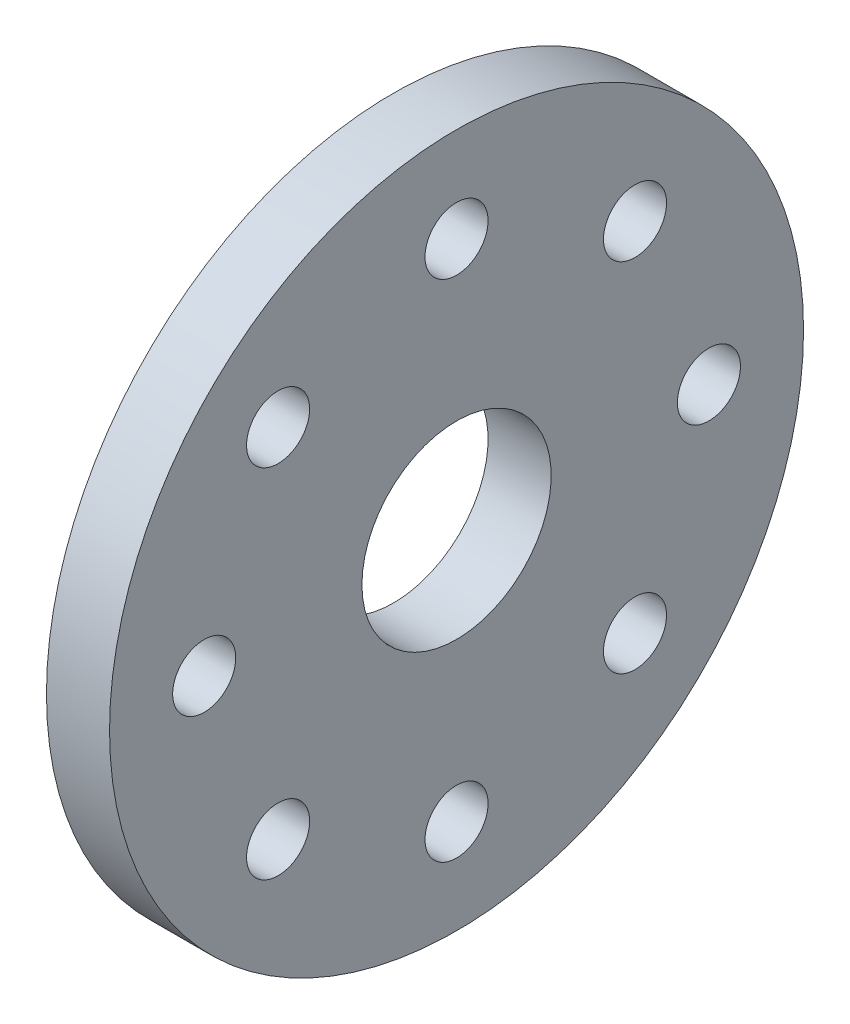
ISO-10303-21;
HEADER;
FILE_DESCRIPTION(('STEP AP214'),'2;1');
FILE_NAME('part.step','',(''),(''),'','','');
FILE_SCHEMA(('AUTOMOTIVE_DESIGN { 1 0 10303 214 1 1 1 1 }'));
ENDSEC;
DATA;
#1=APPLICATION_CONTEXT('core data for automotive mechanical design processes');
#2=APPLICATION_PROTOCOL_DEFINITION('international standard','automotive_design',2000,#1);
#3=PRODUCT_CONTEXT('',#1,'mechanical');
#4=PRODUCT('Part','Part','',(#3));
#5=PRODUCT_RELATED_PRODUCT_CATEGORY('part','',(#4));
#6=PRODUCT_DEFINITION_FORMATION('','',#4);
#7=PRODUCT_DEFINITION_CONTEXT('part definition',#1,'design');
#8=PRODUCT_DEFINITION('design','',#6,#7);
#9=PRODUCT_DEFINITION_SHAPE('','',#8);
#10=(LENGTH_UNIT() NAMED_UNIT(*) SI_UNIT(.MILLI.,.METRE.));
#11=(NAMED_UNIT(*) PLANE_ANGLE_UNIT() SI_UNIT($,.RADIAN.));
#12=(NAMED_UNIT(*) SI_UNIT($,.STERADIAN.) SOLID_ANGLE_UNIT());
#13=UNCERTAINTY_MEASURE_WITH_UNIT(LENGTH_MEASURE(1.E-05),#10,'distance_accuracy_value','');
#14=(GEOMETRIC_REPRESENTATION_CONTEXT(3) GLOBAL_UNCERTAINTY_ASSIGNED_CONTEXT((#13)) GLOBAL_UNIT_ASSIGNED_CONTEXT((#10,
#11,#12)) REPRESENTATION_CONTEXT('',''));
#15=CARTESIAN_POINT('',(0.,0.,0.));
#16=DIRECTION('',(0.,0.,1.));
#17=DIRECTION('',(1.,0.,0.));
#18=AXIS2_PLACEMENT_3D('',#15,#16,#17);
#19=CARTESIAN_POINT('',(0.,0.,0.));
#20=DIRECTION('',(-1.,0.,0.));
#21=DIRECTION('',(0.,0.,1.));
#22=AXIS2_PLACEMENT_3D('',#19,#20,#21);
#23=CYLINDRICAL_SURFACE('',#22,3.);
#24=CARTESIAN_POINT('',(1.,0.,0.));
#25=DIRECTION('',(-1.,0.,0.));
#26=DIRECTION('',(0.,0.,1.));
#27=AXIS2_PLACEMENT_3D('',#24,#25,#26);
#28=CIRCLE('',#27,3.);
#29=CARTESIAN_POINT('',(1.,0.,3.));
#30=VERTEX_POINT('',#29);
#31=EDGE_CURVE('E28',#30,#30,#28,.T.);
#32=ORIENTED_EDGE('',*,*,#31,.F.);
#33=EDGE_LOOP('',(#32));
#34=FACE_BOUND('',#33,.T.);
#35=CARTESIAN_POINT('',(-1.,0.,0.));
#36=DIRECTION('',(-1.,0.,0.));
#37=DIRECTION('',(0.,0.,1.));
#38=AXIS2_PLACEMENT_3D('',#35,#36,#37);
#39=CIRCLE('',#38,3.);
#40=CARTESIAN_POINT('',(-1.,0.,3.));
#41=VERTEX_POINT('',#40);
#42=EDGE_CURVE('E9',#41,#41,#39,.T.);
#43=ORIENTED_EDGE('',*,*,#42,.T.);
#44=EDGE_LOOP('',(#43));
#45=FACE_BOUND('',#44,.T.);
#46=ADVANCED_FACE('F14',(#34,#45),#23,.F.);
#47=CARTESIAN_POINT('',(-1.,3.,0.));
#48=DIRECTION('',(1.,0.,0.));
#49=DIRECTION('',(0.,0.,-1.));
#50=AXIS2_PLACEMENT_3D('',#47,#48,#49);
#51=PLANE('',#50);
#52=CARTESIAN_POINT('',(-1.,5.65685424949245,5.65685424949231));
#53=DIRECTION('',(-1.,0.,0.));
#54=DIRECTION('',(0.,-0.707106781186539,0.707106781186556));
#55=AXIS2_PLACEMENT_3D('',#52,#53,#54);
#56=CIRCLE('',#55,1.);
#57=CARTESIAN_POINT('',(-1.,4.94974746830591,6.36396103067887));
#58=VERTEX_POINT('',#57);
#59=EDGE_CURVE('E76',#58,#58,#56,.T.);
#60=ORIENTED_EDGE('',*,*,#59,.F.);
#61=EDGE_LOOP('',(#60));
#62=FACE_BOUND('',#61,.T.);
#63=CARTESIAN_POINT('',(-1.,0.,8.));
#64=DIRECTION('',(-1.,0.,0.));
#65=DIRECTION('',(0.,-1.,0.));
#66=AXIS2_PLACEMENT_3D('',#63,#64,#65);
#67=CIRCLE('',#66,1.);
#68=CARTESIAN_POINT('',(-1.,-0.999999999999916,8.00000000000001));
#69=VERTEX_POINT('',#68);
#70=EDGE_CURVE('E70',#69,#69,#67,.T.);
#71=ORIENTED_EDGE('',*,*,#70,.F.);
#72=EDGE_LOOP('',(#71));
#73=FACE_BOUND('',#72,.T.);
#74=CARTESIAN_POINT('',(-1.,-5.65685424949233,5.65685424949243));
#75=DIRECTION('',(-1.,0.,0.));
#76=DIRECTION('',(0.,-0.707106781186554,-0.707106781186541));
#77=AXIS2_PLACEMENT_3D('',#74,#75,#76);
#78=CIRCLE('',#77,1.);
#79=CARTESIAN_POINT('',(-1.,-6.36396103067888,4.94974746830589));
#80=VERTEX_POINT('',#79);
#81=EDGE_CURVE('E64',#80,#80,#78,.T.);
#82=ORIENTED_EDGE('',*,*,#81,.F.);
#83=EDGE_LOOP('',(#82));
#84=FACE_BOUND('',#83,.T.);
#85=CARTESIAN_POINT('',(-1.,-8.,0.));
#86=DIRECTION('',(-1.,0.,0.));
#87=DIRECTION('',(0.,0.,-1.));
#88=AXIS2_PLACEMENT_3D('',#85,#86,#87);
#89=CIRCLE('',#88,1.);
#90=CARTESIAN_POINT('',(-1.,-8.,-1.));
#91=VERTEX_POINT('',#90);
#92=EDGE_CURVE('E58',#91,#91,#89,.T.);
#93=ORIENTED_EDGE('',*,*,#92,.F.);
#94=EDGE_LOOP('',(#93));
#95=FACE_BOUND('',#94,.T.);
#96=CARTESIAN_POINT('',(-1.,-5.65685424949241,-5.65685424949235));
#97=DIRECTION('',(-1.,0.,0.));
#98=DIRECTION('',(0.,0.707106781186544,-0.707106781186551));
#99=AXIS2_PLACEMENT_3D('',#96,#97,#98);
#100=CIRCLE('',#99,1.);
#101=CARTESIAN_POINT('',(-1.,-4.94974746830587,-6.3639610306789));
#102=VERTEX_POINT('',#101);
#103=EDGE_CURVE('E52',#102,#102,#100,.T.);
#104=ORIENTED_EDGE('',*,*,#103,.F.);
#105=EDGE_LOOP('',(#104));
#106=FACE_BOUND('',#105,.T.);
#107=CARTESIAN_POINT('',(-1.,0.,-8.));
#108=DIRECTION('',(-1.,0.,0.));
#109=DIRECTION('',(0.,1.,0.));
#110=AXIS2_PLACEMENT_3D('',#107,#108,#109);
#111=CIRCLE('',#110,1.);
#112=CARTESIAN_POINT('',(-1.,0.999999999999972,-8.));
#113=VERTEX_POINT('',#112);
#114=EDGE_CURVE('E46',#113,#113,#111,.T.);
#115=ORIENTED_EDGE('',*,*,#114,.F.);
#116=EDGE_LOOP('',(#115));
#117=FACE_BOUND('',#116,.T.);
#118=CARTESIAN_POINT('',(-1.,5.65685424949237,-5.65685424949239));
#119=DIRECTION('',(-1.,0.,0.));
#120=DIRECTION('',(0.,0.707106781186549,0.707106781186546));
#121=AXIS2_PLACEMENT_3D('',#118,#119,#120);
#122=CIRCLE('',#121,1.);
#123=CARTESIAN_POINT('',(-1.,6.36396103067892,-4.94974746830584));
#124=VERTEX_POINT('',#123);
#125=EDGE_CURVE('E40',#124,#124,#122,.T.);
#126=ORIENTED_EDGE('',*,*,#125,.F.);
#127=EDGE_LOOP('',(#126));
#128=FACE_BOUND('',#127,.T.);
#129=CARTESIAN_POINT('',(-1.,8.,0.));
#130=DIRECTION('',(-1.,0.,0.));
#131=DIRECTION('',(0.,0.,1.));
#132=AXIS2_PLACEMENT_3D('',#129,#130,#131);
#133=CIRCLE('',#132,1.);
#134=CARTESIAN_POINT('',(-1.,8.,1.));
#135=VERTEX_POINT('',#134);
#136=EDGE_CURVE('E34',#135,#135,#133,.T.);
#137=ORIENTED_EDGE('',*,*,#136,.F.);
#138=EDGE_LOOP('',(#137));
#139=FACE_BOUND('',#138,.T.);
#140=ORIENTED_EDGE('',*,*,#42,.F.);
#141=EDGE_LOOP('',(#140));
#142=FACE_BOUND('',#141,.T.);
#143=CARTESIAN_POINT('',(-1.,0.,0.));
#144=DIRECTION('',(-1.,0.,0.));
#145=DIRECTION('',(0.,0.,1.));
#146=AXIS2_PLACEMENT_3D('',#143,#144,#145);
#147=CIRCLE('',#146,11.);
#148=CARTESIAN_POINT('',(-1.,0.,11.));
#149=VERTEX_POINT('',#148);
#150=EDGE_CURVE('E20',#149,#149,#147,.T.);
#151=ORIENTED_EDGE('',*,*,#150,.T.);
#152=EDGE_LOOP('',(#151));
#153=FACE_BOUND('',#152,.T.);
#154=ADVANCED_FACE('F92',(#62,#73,#84,#95,#106,#117,#128,#139,#142,#153),#51,.F.);
#155=CARTESIAN_POINT('',(0.,0.,0.));
#156=DIRECTION('',(-1.,0.,0.));
#157=DIRECTION('',(0.,0.,1.));
#158=AXIS2_PLACEMENT_3D('',#155,#156,#157);
#159=CYLINDRICAL_SURFACE('',#158,11.);
#160=ORIENTED_EDGE('',*,*,#150,.F.);
#161=EDGE_LOOP('',(#160));
#162=FACE_BOUND('',#161,.T.);
#163=CARTESIAN_POINT('',(1.,0.,0.));
#164=DIRECTION('',(-1.,0.,0.));
#165=DIRECTION('',(0.,0.,1.));
#166=AXIS2_PLACEMENT_3D('',#163,#164,#165);
#167=CIRCLE('',#166,11.);
#168=CARTESIAN_POINT('',(1.,0.,11.));
#169=VERTEX_POINT('',#168);
#170=EDGE_CURVE('E24',#169,#169,#167,.T.);
#171=ORIENTED_EDGE('',*,*,#170,.T.);
#172=EDGE_LOOP('',(#171));
#173=FACE_BOUND('',#172,.T.);
#174=ADVANCED_FACE('F95',(#162,#173),#159,.T.);
#175=CARTESIAN_POINT('',(1.,11.,0.));
#176=DIRECTION('',(-1.,0.,0.));
#177=DIRECTION('',(0.,0.,1.));
#178=AXIS2_PLACEMENT_3D('',#175,#176,#177);
#179=PLANE('',#178);
#180=CARTESIAN_POINT('',(1.,5.65685424949245,5.65685424949231));
#181=DIRECTION('',(-1.,0.,0.));
#182=DIRECTION('',(0.,-0.707106781186539,0.707106781186556));
#183=AXIS2_PLACEMENT_3D('',#180,#181,#182);
#184=CIRCLE('',#183,1.);
#185=CARTESIAN_POINT('',(1.,4.94974746830591,6.36396103067887));
#186=VERTEX_POINT('',#185);
#187=EDGE_CURVE('E73',#186,#186,#184,.T.);
#188=ORIENTED_EDGE('',*,*,#187,.T.);
#189=EDGE_LOOP('',(#188));
#190=FACE_BOUND('',#189,.T.);
#191=CARTESIAN_POINT('',(1.,0.,8.));
#192=DIRECTION('',(-1.,0.,0.));
#193=DIRECTION('',(0.,-1.,0.));
#194=AXIS2_PLACEMENT_3D('',#191,#192,#193);
#195=CIRCLE('',#194,1.);
#196=CARTESIAN_POINT('',(1.,-0.999999999999916,8.00000000000001));
#197=VERTEX_POINT('',#196);
#198=EDGE_CURVE('E67',#197,#197,#195,.T.);
#199=ORIENTED_EDGE('',*,*,#198,.T.);
#200=EDGE_LOOP('',(#199));
#201=FACE_BOUND('',#200,.T.);
#202=CARTESIAN_POINT('',(1.,-5.65685424949233,5.65685424949243));
#203=DIRECTION('',(-1.,0.,0.));
#204=DIRECTION('',(0.,-0.707106781186554,-0.707106781186541));
#205=AXIS2_PLACEMENT_3D('',#202,#203,#204);
#206=CIRCLE('',#205,1.);
#207=CARTESIAN_POINT('',(1.,-6.36396103067888,4.94974746830589));
#208=VERTEX_POINT('',#207);
#209=EDGE_CURVE('E61',#208,#208,#206,.T.);
#210=ORIENTED_EDGE('',*,*,#209,.T.);
#211=EDGE_LOOP('',(#210));
#212=FACE_BOUND('',#211,.T.);
#213=CARTESIAN_POINT('',(1.,-8.,0.));
#214=DIRECTION('',(-1.,0.,0.));
#215=DIRECTION('',(0.,0.,-1.));
#216=AXIS2_PLACEMENT_3D('',#213,#214,#215);
#217=CIRCLE('',#216,1.);
#218=CARTESIAN_POINT('',(1.,-8.,-1.));
#219=VERTEX_POINT('',#218);
#220=EDGE_CURVE('E55',#219,#219,#217,.T.);
#221=ORIENTED_EDGE('',*,*,#220,.T.);
#222=EDGE_LOOP('',(#221));
#223=FACE_BOUND('',#222,.T.);
#224=CARTESIAN_POINT('',(1.,-5.65685424949241,-5.65685424949235));
#225=DIRECTION('',(-1.,0.,0.));
#226=DIRECTION('',(0.,0.707106781186544,-0.707106781186551));
#227=AXIS2_PLACEMENT_3D('',#224,#225,#226);
#228=CIRCLE('',#227,1.);
#229=CARTESIAN_POINT('',(1.,-4.94974746830587,-6.3639610306789));
#230=VERTEX_POINT('',#229);
#231=EDGE_CURVE('E49',#230,#230,#228,.T.);
#232=ORIENTED_EDGE('',*,*,#231,.T.);
#233=EDGE_LOOP('',(#232));
#234=FACE_BOUND('',#233,.T.);
#235=CARTESIAN_POINT('',(1.,0.,-8.));
#236=DIRECTION('',(-1.,0.,0.));
#237=DIRECTION('',(0.,1.,0.));
#238=AXIS2_PLACEMENT_3D('',#235,#236,#237);
#239=CIRCLE('',#238,1.);
#240=CARTESIAN_POINT('',(1.,0.999999999999972,-8.));
#241=VERTEX_POINT('',#240);
#242=EDGE_CURVE('E43',#241,#241,#239,.T.);
#243=ORIENTED_EDGE('',*,*,#242,.T.);
#244=EDGE_LOOP('',(#243));
#245=FACE_BOUND('',#244,.T.);
#246=CARTESIAN_POINT('',(1.,5.65685424949237,-5.65685424949239));
#247=DIRECTION('',(-1.,0.,0.));
#248=DIRECTION('',(0.,0.707106781186549,0.707106781186546));
#249=AXIS2_PLACEMENT_3D('',#246,#247,#248);
#250=CIRCLE('',#249,1.);
#251=CARTESIAN_POINT('',(1.,6.36396103067892,-4.94974746830584));
#252=VERTEX_POINT('',#251);
#253=EDGE_CURVE('E37',#252,#252,#250,.T.);
#254=ORIENTED_EDGE('',*,*,#253,.T.);
#255=EDGE_LOOP('',(#254));
#256=FACE_BOUND('',#255,.T.);
#257=CARTESIAN_POINT('',(1.,8.,0.));
#258=DIRECTION('',(-1.,0.,0.));
#259=DIRECTION('',(0.,0.,1.));
#260=AXIS2_PLACEMENT_3D('',#257,#258,#259);
#261=CIRCLE('',#260,1.);
#262=CARTESIAN_POINT('',(1.,8.,1.));
#263=VERTEX_POINT('',#262);
#264=EDGE_CURVE('E33',#263,#263,#261,.T.);
#265=ORIENTED_EDGE('',*,*,#264,.T.);
#266=EDGE_LOOP('',(#265));
#267=FACE_BOUND('',#266,.T.);
#268=ORIENTED_EDGE('',*,*,#170,.F.);
#269=EDGE_LOOP('',(#268));
#270=FACE_BOUND('',#269,.T.);
#271=ORIENTED_EDGE('',*,*,#31,.T.);
#272=EDGE_LOOP('',(#271));
#273=FACE_BOUND('',#272,.T.);
#274=ADVANCED_FACE('F82',(#190,#201,#212,#223,#234,#245,#256,#267,#270,#273),#179,.F.);
#275=CARTESIAN_POINT('',(1.,8.,0.));
#276=DIRECTION('',(-1.,0.,0.));
#277=DIRECTION('',(0.,0.,1.));
#278=AXIS2_PLACEMENT_3D('',#275,#276,#277);
#279=CYLINDRICAL_SURFACE('',#278,1.);
#280=ORIENTED_EDGE('',*,*,#264,.F.);
#281=EDGE_LOOP('',(#280));
#282=FACE_BOUND('',#281,.T.);
#283=ORIENTED_EDGE('',*,*,#136,.T.);
#284=EDGE_LOOP('',(#283));
#285=FACE_BOUND('',#284,.T.);
#286=ADVANCED_FACE('F111',(#282,#285),#279,.F.);
#287=CARTESIAN_POINT('',(1.,5.65685424949237,-5.65685424949239));
#288=DIRECTION('',(-1.,0.,0.));
#289=DIRECTION('',(0.,0.,1.));
#290=AXIS2_PLACEMENT_3D('',#287,#288,#289);
#291=CYLINDRICAL_SURFACE('',#290,1.);
#292=ORIENTED_EDGE('',*,*,#253,.F.);
#293=EDGE_LOOP('',(#292));
#294=FACE_BOUND('',#293,.T.);
#295=ORIENTED_EDGE('',*,*,#125,.T.);
#296=EDGE_LOOP('',(#295));
#297=FACE_BOUND('',#296,.T.);
#298=ADVANCED_FACE('F113',(#294,#297),#291,.F.);
#299=CARTESIAN_POINT('',(1.,0.,-8.));
#300=DIRECTION('',(-1.,0.,0.));
#301=DIRECTION('',(0.,0.,1.));
#302=AXIS2_PLACEMENT_3D('',#299,#300,#301);
#303=CYLINDRICAL_SURFACE('',#302,1.);
#304=ORIENTED_EDGE('',*,*,#242,.F.);
#305=EDGE_LOOP('',(#304));
#306=FACE_BOUND('',#305,.T.);
#307=ORIENTED_EDGE('',*,*,#114,.T.);
#308=EDGE_LOOP('',(#307));
#309=FACE_BOUND('',#308,.T.);
#310=ADVANCED_FACE('F122',(#306,#309),#303,.F.);
#311=CARTESIAN_POINT('',(1.,-5.65685424949241,-5.65685424949235));
#312=DIRECTION('',(-1.,0.,0.));
#313=DIRECTION('',(0.,0.,1.));
#314=AXIS2_PLACEMENT_3D('',#311,#312,#313);
#315=CYLINDRICAL_SURFACE('',#314,1.);
#316=ORIENTED_EDGE('',*,*,#231,.F.);
#317=EDGE_LOOP('',(#316));
#318=FACE_BOUND('',#317,.T.);
#319=ORIENTED_EDGE('',*,*,#103,.T.);
#320=EDGE_LOOP('',(#319));
#321=FACE_BOUND('',#320,.T.);
#322=ADVANCED_FACE('F178',(#318,#321),#315,.F.);
#323=CARTESIAN_POINT('',(1.,-8.,0.));
#324=DIRECTION('',(-1.,0.,0.));
#325=DIRECTION('',(0.,0.,1.));
#326=AXIS2_PLACEMENT_3D('',#323,#324,#325);
#327=CYLINDRICAL_SURFACE('',#326,1.);
#328=ORIENTED_EDGE('',*,*,#220,.F.);
#329=EDGE_LOOP('',(#328));
#330=FACE_BOUND('',#329,.T.);
#331=ORIENTED_EDGE('',*,*,#92,.T.);
#332=EDGE_LOOP('',(#331));
#333=FACE_BOUND('',#332,.T.);
#334=ADVANCED_FACE('F186',(#330,#333),#327,.F.);
#335=CARTESIAN_POINT('',(1.,-5.65685424949233,5.65685424949243));
#336=DIRECTION('',(-1.,0.,0.));
#337=DIRECTION('',(0.,0.,1.));
#338=AXIS2_PLACEMENT_3D('',#335,#336,#337);
#339=CYLINDRICAL_SURFACE('',#338,1.);
#340=ORIENTED_EDGE('',*,*,#209,.F.);
#341=EDGE_LOOP('',(#340));
#342=FACE_BOUND('',#341,.T.);
#343=ORIENTED_EDGE('',*,*,#81,.T.);
#344=EDGE_LOOP('',(#343));
#345=FACE_BOUND('',#344,.T.);
#346=ADVANCED_FACE('F195',(#342,#345),#339,.F.);
#347=CARTESIAN_POINT('',(1.,0.,8.));
#348=DIRECTION('',(-1.,0.,0.));
#349=DIRECTION('',(0.,0.,1.));
#350=AXIS2_PLACEMENT_3D('',#347,#348,#349);
#351=CYLINDRICAL_SURFACE('',#350,1.);
#352=ORIENTED_EDGE('',*,*,#198,.F.);
#353=EDGE_LOOP('',(#352));
#354=FACE_BOUND('',#353,.T.);
#355=ORIENTED_EDGE('',*,*,#70,.T.);
#356=EDGE_LOOP('',(#355));
#357=FACE_BOUND('',#356,.T.);
#358=ADVANCED_FACE('F88',(#354,#357),#351,.F.);
#359=CARTESIAN_POINT('',(1.,5.65685424949245,5.65685424949231));
#360=DIRECTION('',(-1.,0.,0.));
#361=DIRECTION('',(0.,0.,1.));
#362=AXIS2_PLACEMENT_3D('',#359,#360,#361);
#363=CYLINDRICAL_SURFACE('',#362,1.);
#364=ORIENTED_EDGE('',*,*,#187,.F.);
#365=EDGE_LOOP('',(#364));
#366=FACE_BOUND('',#365,.T.);
#367=ORIENTED_EDGE('',*,*,#59,.T.);
#368=EDGE_LOOP('',(#367));
#369=FACE_BOUND('',#368,.T.);
#370=ADVANCED_FACE('F85',(#366,#369),#363,.F.);
#371=CLOSED_SHELL('',(#46,#154,#174,#274,#286,#298,#310,#322,#334,#346,#358,#370));
#372=MANIFOLD_SOLID_BREP('B1',#371);
#373=ADVANCED_BREP_SHAPE_REPRESENTATION('',(#18,#372),#14);
#374=SHAPE_DEFINITION_REPRESENTATION(#9,#373);
ENDSEC;
END-ISO-10303-21;
